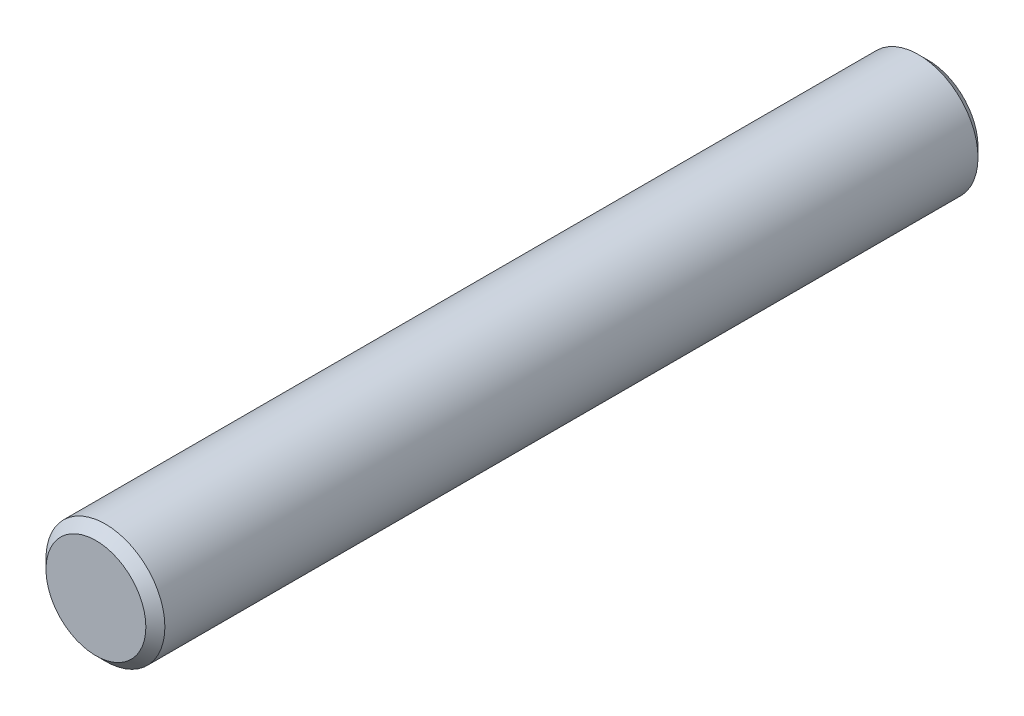
ISO-10303-21;
HEADER;
FILE_DESCRIPTION(('STEP AP214'),'2;1');
FILE_NAME('part.step','',(''),(''),'','','');
FILE_SCHEMA(('AUTOMOTIVE_DESIGN { 1 0 10303 214 1 1 1 1 }'));
ENDSEC;
DATA;
#1=APPLICATION_CONTEXT('core data for automotive mechanical design processes');
#2=APPLICATION_PROTOCOL_DEFINITION('international standard','automotive_design',2000,#1);
#3=PRODUCT_CONTEXT('',#1,'mechanical');
#4=PRODUCT('Part','Part','',(#3));
#5=PRODUCT_RELATED_PRODUCT_CATEGORY('part','',(#4));
#6=PRODUCT_DEFINITION_FORMATION('','',#4);
#7=PRODUCT_DEFINITION_CONTEXT('part definition',#1,'design');
#8=PRODUCT_DEFINITION('design','',#6,#7);
#9=PRODUCT_DEFINITION_SHAPE('','',#8);
#10=(LENGTH_UNIT() NAMED_UNIT(*) SI_UNIT(.MILLI.,.METRE.));
#11=(NAMED_UNIT(*) PLANE_ANGLE_UNIT() SI_UNIT($,.RADIAN.));
#12=(NAMED_UNIT(*) SI_UNIT($,.STERADIAN.) SOLID_ANGLE_UNIT());
#13=UNCERTAINTY_MEASURE_WITH_UNIT(LENGTH_MEASURE(1.E-05),#10,'distance_accuracy_value','');
#14=(GEOMETRIC_REPRESENTATION_CONTEXT(3) GLOBAL_UNCERTAINTY_ASSIGNED_CONTEXT((#13)) GLOBAL_UNIT_ASSIGNED_CONTEXT((#10,
#11,#12)) REPRESENTATION_CONTEXT('',''));
#15=CARTESIAN_POINT('',(0.,0.,0.));
#16=DIRECTION('',(0.,0.,1.));
#17=DIRECTION('',(1.,0.,0.));
#18=AXIS2_PLACEMENT_3D('',#15,#16,#17);
#19=CARTESIAN_POINT('',(0.,0.,-22.225));
#20=DIRECTION('',(0.,0.,1.));
#21=DIRECTION('',(1.,0.,0.));
#22=AXIS2_PLACEMENT_3D('',#19,#20,#21);
#23=CYLINDRICAL_SURFACE('',#22,1.5875);
#24=CARTESIAN_POINT('',(0.,0.,-0.254000000000001));
#25=DIRECTION('',(0.,0.,1.));
#26=DIRECTION('',(1.,0.,0.));
#27=AXIS2_PLACEMENT_3D('',#24,#25,#26);
#28=CIRCLE('',#27,1.5875);
#29=CARTESIAN_POINT('',(1.5875,0.,-0.254000000000001));
#30=VERTEX_POINT('',#29);
#31=EDGE_CURVE('E48',#30,#30,#28,.F.);
#32=ORIENTED_EDGE('',*,*,#31,.T.);
#33=EDGE_LOOP('',(#32));
#34=FACE_BOUND('',#33,.T.);
#35=CARTESIAN_POINT('',(0.,0.,-21.971));
#36=DIRECTION('',(0.,0.,1.));
#37=DIRECTION('',(1.,0.,0.));
#38=AXIS2_PLACEMENT_3D('',#35,#36,#37);
#39=CIRCLE('',#38,1.5875);
#40=CARTESIAN_POINT('',(1.5875,0.,-21.971));
#41=VERTEX_POINT('',#40);
#42=EDGE_CURVE('E53',#41,#41,#39,.T.);
#43=ORIENTED_EDGE('',*,*,#42,.T.);
#44=EDGE_LOOP('',(#43));
#45=FACE_BOUND('',#44,.T.);
#46=ADVANCED_FACE('F39',(#34,#45),#23,.T.);
#47=CARTESIAN_POINT('',(0.,0.,-22.225));
#48=DIRECTION('',(0.,0.,1.));
#49=DIRECTION('',(1.,0.,0.));
#50=AXIS2_PLACEMENT_3D('',#47,#48,#49);
#51=PLANE('',#50);
#52=CARTESIAN_POINT('',(0.,0.,-22.225));
#53=DIRECTION('',(0.,0.,1.));
#54=DIRECTION('',(1.,0.,0.));
#55=AXIS2_PLACEMENT_3D('',#52,#53,#54);
#56=CIRCLE('',#55,1.3335);
#57=CARTESIAN_POINT('',(1.3335,0.,-22.225));
#58=VERTEX_POINT('',#57);
#59=EDGE_CURVE('E10',#58,#58,#56,.F.);
#60=ORIENTED_EDGE('',*,*,#59,.T.);
#61=EDGE_LOOP('',(#60));
#62=FACE_BOUND('',#61,.T.);
#63=ADVANCED_FACE('F75',(#62),#51,.F.);
#64=CARTESIAN_POINT('',(0.,0.,0.));
#65=DIRECTION('',(0.,0.,1.));
#66=DIRECTION('',(1.,0.,0.));
#67=AXIS2_PLACEMENT_3D('',#64,#65,#66);
#68=PLANE('',#67);
#69=CARTESIAN_POINT('',(0.,0.,0.));
#70=DIRECTION('',(0.,0.,1.));
#71=DIRECTION('',(1.,0.,0.));
#72=AXIS2_PLACEMENT_3D('',#69,#70,#71);
#73=CIRCLE('',#72,1.3335);
#74=CARTESIAN_POINT('',(1.3335,0.,0.));
#75=VERTEX_POINT('',#74);
#76=EDGE_CURVE('E58',#75,#75,#73,.T.);
#77=ORIENTED_EDGE('',*,*,#76,.T.);
#78=EDGE_LOOP('',(#77));
#79=FACE_BOUND('',#78,.T.);
#80=ADVANCED_FACE('F65',(#79),#68,.T.);
#81=CARTESIAN_POINT('',(0.,0.,0.));
#82=DIRECTION('',(0.,0.,-1.));
#83=DIRECTION('',(-1.,0.,0.));
#84=AXIS2_PLACEMENT_3D('',#81,#82,#83);
#85=CONICAL_SURFACE('',#84,1.3335,0.785398163397444);
#86=ORIENTED_EDGE('',*,*,#31,.F.);
#87=EDGE_LOOP('',(#86));
#88=FACE_BOUND('',#87,.T.);
#89=ORIENTED_EDGE('',*,*,#76,.F.);
#90=EDGE_LOOP('',(#89));
#91=FACE_BOUND('',#90,.T.);
#92=ADVANCED_FACE('F67',(#88,#91),#85,.T.);
#93=CARTESIAN_POINT('',(0.,0.,-21.971));
#94=DIRECTION('',(0.,0.,1.));
#95=DIRECTION('',(1.,0.,0.));
#96=AXIS2_PLACEMENT_3D('',#93,#94,#95);
#97=CONICAL_SURFACE('',#96,1.5875,0.785398163397447);
#98=ORIENTED_EDGE('',*,*,#59,.F.);
#99=EDGE_LOOP('',(#98));
#100=FACE_BOUND('',#99,.T.);
#101=ORIENTED_EDGE('',*,*,#42,.F.);
#102=EDGE_LOOP('',(#101));
#103=FACE_BOUND('',#102,.T.);
#104=ADVANCED_FACE('F42',(#100,#103),#97,.T.);
#105=CLOSED_SHELL('',(#46,#63,#80,#92,#104));
#106=MANIFOLD_SOLID_BREP('B2',#105);
#107=ADVANCED_BREP_SHAPE_REPRESENTATION('',(#18,#106),#14);
#108=SHAPE_DEFINITION_REPRESENTATION(#9,#107);
ENDSEC;
END-ISO-10303-21;
